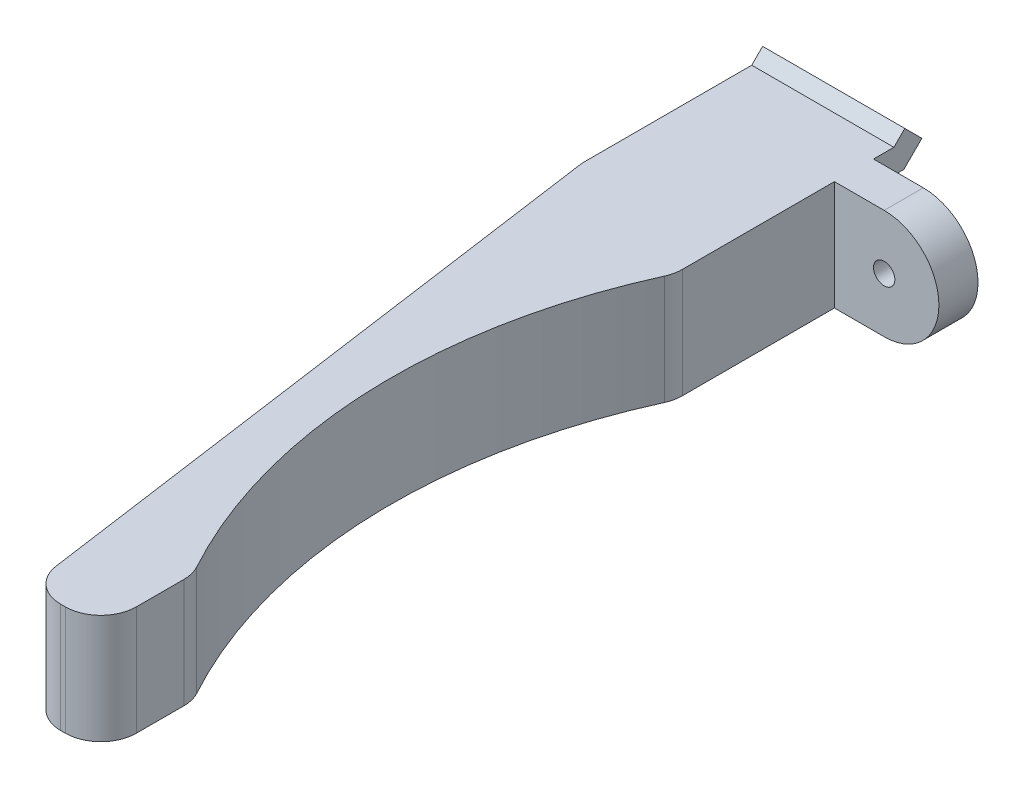
ISO-10303-21;
HEADER;
FILE_DESCRIPTION(('STEP AP214'),'2;1');
FILE_NAME('part.step','',(''),(''),'','','');
FILE_SCHEMA(('AUTOMOTIVE_DESIGN { 1 0 10303 214 1 1 1 1 }'));
ENDSEC;
DATA;
#1=APPLICATION_CONTEXT('core data for automotive mechanical design processes');
#2=APPLICATION_PROTOCOL_DEFINITION('international standard','automotive_design',2000,#1);
#3=PRODUCT_CONTEXT('',#1,'mechanical');
#4=PRODUCT('Part','Part','',(#3));
#5=PRODUCT_RELATED_PRODUCT_CATEGORY('part','',(#4));
#6=PRODUCT_DEFINITION_FORMATION('','',#4);
#7=PRODUCT_DEFINITION_CONTEXT('part definition',#1,'design');
#8=PRODUCT_DEFINITION('design','',#6,#7);
#9=PRODUCT_DEFINITION_SHAPE('','',#8);
#10=(LENGTH_UNIT() NAMED_UNIT(*) SI_UNIT(.MILLI.,.METRE.));
#11=(NAMED_UNIT(*) PLANE_ANGLE_UNIT() SI_UNIT($,.RADIAN.));
#12=(NAMED_UNIT(*) SI_UNIT($,.STERADIAN.) SOLID_ANGLE_UNIT());
#13=UNCERTAINTY_MEASURE_WITH_UNIT(LENGTH_MEASURE(1.E-05),#10,'distance_accuracy_value','');
#14=(GEOMETRIC_REPRESENTATION_CONTEXT(3) GLOBAL_UNCERTAINTY_ASSIGNED_CONTEXT((#13)) GLOBAL_UNIT_ASSIGNED_CONTEXT((#10,
#11,#12)) REPRESENTATION_CONTEXT('',''));
#15=CARTESIAN_POINT('',(0.,0.,0.));
#16=DIRECTION('',(0.,0.,1.));
#17=DIRECTION('',(1.,0.,0.));
#18=AXIS2_PLACEMENT_3D('',#15,#16,#17);
#19=CARTESIAN_POINT('',(5.,-5.8181568544759,5.));
#20=DIRECTION('',(-1.,0.,0.));
#21=DIRECTION('',(0.,0.,1.));
#22=AXIS2_PLACEMENT_3D('',#19,#20,#21);
#23=PLANE('',#22);
#24=DIRECTION('',(0.,0.,1.));
#25=VECTOR('',#24,1.);
#26=CARTESIAN_POINT('',(5.,5.770255584937,-0.149999999997353));
#27=LINE('',#26,#25);
#28=CARTESIAN_POINT('',(5.,5.770255584937,-1.43370490960713));
#29=VERTEX_POINT('',#28);
#30=CARTESIAN_POINT('',(5.,5.770255584937,0.));
#31=VERTEX_POINT('',#30);
#32=EDGE_CURVE('E324',#29,#31,#27,.T.);
#33=ORIENTED_EDGE('',*,*,#32,.T.);
#34=DIRECTION('',(0.,-1.,0.));
#35=VECTOR('',#34,1.);
#36=CARTESIAN_POINT('',(5.,-1.92974441506292,0.));
#37=LINE('',#36,#35);
#38=CARTESIAN_POINT('',(5.,4.07025558493702,0.));
#39=VERTEX_POINT('',#38);
#40=EDGE_CURVE('E212',#31,#39,#37,.T.);
#41=ORIENTED_EDGE('',*,*,#40,.T.);
#42=DIRECTION('',(0.,-1.27213054907211E-13,-1.));
#43=VECTOR('',#42,1.);
#44=CARTESIAN_POINT('',(5.,4.07025558493702,0.));
#45=LINE('',#44,#43);
#46=CARTESIAN_POINT('',(5.,4.070255584937,-2.13786796564139));
#47=VERTEX_POINT('',#46);
#48=EDGE_CURVE('E297',#39,#47,#45,.T.);
#49=ORIENTED_EDGE('',*,*,#48,.T.);
#50=DIRECTION('',(0.,0.707106781186548,-0.707106781186547));
#51=VECTOR('',#50,1.);
#52=CARTESIAN_POINT('',(5.,5.3344691473101,-3.40208152801448));
#53=LINE('',#52,#51);
#54=CARTESIAN_POINT('',(5.,5.3344691473101,-3.40208152801448));
#55=VERTEX_POINT('',#54);
#56=EDGE_CURVE('E295',#47,#55,#53,.T.);
#57=ORIENTED_EDGE('',*,*,#56,.T.);
#58=DIRECTION('',(0.,0.707106781186546,0.707106781186549));
#59=VECTOR('',#58,1.);
#60=CARTESIAN_POINT('',(5.,6.53655067532722,-2.19999999999735));
#61=LINE('',#60,#59);
#62=CARTESIAN_POINT('',(5.,6.53655067532722,-2.19999999999735));
#63=VERTEX_POINT('',#62);
#64=EDGE_CURVE('E292',#55,#63,#61,.T.);
#65=ORIENTED_EDGE('',*,*,#64,.T.);
#66=DIRECTION('',(0.,-0.707106781186548,0.707106781186547));
#67=VECTOR('',#66,1.);
#68=CARTESIAN_POINT('',(5.,5.770255584937,-1.43370490960713));
#69=LINE('',#68,#67);
#70=EDGE_CURVE('E290',#63,#29,#69,.T.);
#71=ORIENTED_EDGE('',*,*,#70,.T.);
#72=EDGE_LOOP('',(#33,#41,#49,#57,#65,#71));
#73=FACE_BOUND('',#72,.T.);
#74=ADVANCED_FACE('F33',(#73),#23,.F.);
#75=DIRECTION('',(0.,0.,1.));
#76=VECTOR('',#75,1.);
#77=CARTESIAN_POINT('',(5.,-0.229744415063001,-0.149999999997353));
#78=LINE('',#77,#76);
#79=CARTESIAN_POINT('',(5.,-0.229744415063001,-1.43370490960713));
#80=VERTEX_POINT('',#79);
#81=CARTESIAN_POINT('',(5.,-0.229744415063001,0.));
#82=VERTEX_POINT('',#81);
#83=EDGE_CURVE('E209',#80,#82,#78,.T.);
#84=ORIENTED_EDGE('',*,*,#83,.T.);
#85=CARTESIAN_POINT('',(5.,-1.92974441506292,0.));
#86=VERTEX_POINT('',#85);
#87=EDGE_CURVE('E206',#82,#86,#37,.T.);
#88=ORIENTED_EDGE('',*,*,#87,.T.);
#89=DIRECTION('',(0.,0.,-1.));
#90=VECTOR('',#89,1.);
#91=CARTESIAN_POINT('',(5.,-1.929744415063,-0.149999999997353));
#92=LINE('',#91,#90);
#93=CARTESIAN_POINT('',(5.,-1.929744415063,-2.13786796564139));
#94=VERTEX_POINT('',#93);
#95=EDGE_CURVE('E189',#86,#94,#92,.T.);
#96=ORIENTED_EDGE('',*,*,#95,.T.);
#97=DIRECTION('',(0.,0.707106781186549,-0.707106781186546));
#98=VECTOR('',#97,1.);
#99=CARTESIAN_POINT('',(5.,-0.665530852689905,-3.40208152801448));
#100=LINE('',#99,#98);
#101=CARTESIAN_POINT('',(5.,-0.665530852689905,-3.40208152801448));
#102=VERTEX_POINT('',#101);
#103=EDGE_CURVE('E202',#94,#102,#100,.T.);
#104=ORIENTED_EDGE('',*,*,#103,.T.);
#105=DIRECTION('',(0.,0.707106781186548,0.707106781186548));
#106=VECTOR('',#105,1.);
#107=CARTESIAN_POINT('',(5.,0.536550675327224,-2.19999999999735));
#108=LINE('',#107,#106);
#109=CARTESIAN_POINT('',(5.,0.536550675327225,-2.19999999999735));
#110=VERTEX_POINT('',#109);
#111=EDGE_CURVE('E263',#102,#110,#108,.T.);
#112=ORIENTED_EDGE('',*,*,#111,.T.);
#113=DIRECTION('',(0.,-0.707106781186546,0.707106781186549));
#114=VECTOR('',#113,1.);
#115=CARTESIAN_POINT('',(5.,-0.229744415063001,-1.43370490960713));
#116=LINE('',#115,#114);
#117=EDGE_CURVE('E261',#110,#80,#116,.T.);
#118=ORIENTED_EDGE('',*,*,#117,.T.);
#119=EDGE_LOOP('',(#84,#88,#96,#104,#112,#118));
#120=FACE_BOUND('',#119,.T.);
#121=ADVANCED_FACE('F207',(#120),#23,.F.);
#122=CARTESIAN_POINT('',(5.,5.770255584937,2.75000000000266));
#123=VERTEX_POINT('',#122);
#124=CARTESIAN_POINT('',(5.,5.770255584937,13.4501334916828));
#125=VERTEX_POINT('',#124);
#126=EDGE_CURVE('E299',#123,#125,#27,.T.);
#127=ORIENTED_EDGE('',*,*,#126,.T.);
#128=DIRECTION('',(0.,-1.,0.));
#129=VECTOR('',#128,1.);
#130=CARTESIAN_POINT('',(5.,-1.92974441506298,13.4501334916828));
#131=LINE('',#130,#129);
#132=CARTESIAN_POINT('',(5.,-1.92974441506298,13.4501334916828));
#133=VERTEX_POINT('',#132);
#134=EDGE_CURVE('E353',#125,#133,#131,.T.);
#135=ORIENTED_EDGE('',*,*,#134,.T.);
#136=CARTESIAN_POINT('',(5.,-1.929744415063,2.75000000000266));
#137=VERTEX_POINT('',#136);
#138=EDGE_CURVE('E201',#133,#137,#92,.T.);
#139=ORIENTED_EDGE('',*,*,#138,.T.);
#140=DIRECTION('',(0.,-1.,0.));
#141=VECTOR('',#140,1.);
#142=CARTESIAN_POINT('',(5.,-1.92974441506292,2.75000000000266));
#143=LINE('',#142,#141);
#144=EDGE_CURVE('E417',#123,#137,#143,.T.);
#145=ORIENTED_EDGE('',*,*,#144,.F.);
#146=EDGE_LOOP('',(#127,#135,#139,#145));
#147=FACE_BOUND('',#146,.T.);
#148=ADVANCED_FACE('F442',(#147),#23,.F.);
#149=CARTESIAN_POINT('',(-5.,-5.8181568544759,5.));
#150=DIRECTION('',(1.,0.,0.));
#151=DIRECTION('',(0.,0.,-1.));
#152=AXIS2_PLACEMENT_3D('',#149,#150,#151);
#153=PLANE('',#152);
#154=DIRECTION('',(0.,0.,1.));
#155=VECTOR('',#154,1.);
#156=CARTESIAN_POINT('',(-5.,-1.929744415063,-0.149999999997353));
#157=LINE('',#156,#155);
#158=CARTESIAN_POINT('',(-5.,-1.929744415063,-2.13786796564139));
#159=VERTEX_POINT('',#158);
#160=CARTESIAN_POINT('',(-5.,-1.92974441506299,10.5));
#161=VERTEX_POINT('',#160);
#162=EDGE_CURVE('E277',#159,#161,#157,.T.);
#163=ORIENTED_EDGE('',*,*,#162,.T.);
#164=DIRECTION('',(0.,1.,0.));
#165=VECTOR('',#164,1.);
#166=CARTESIAN_POINT('',(-5.,-53.8851870945324,10.5));
#167=LINE('',#166,#165);
#168=CARTESIAN_POINT('',(-5.,5.770255584937,10.5));
#169=VERTEX_POINT('',#168);
#170=EDGE_CURVE('E256',#161,#169,#167,.T.);
#171=ORIENTED_EDGE('',*,*,#170,.T.);
#172=DIRECTION('',(0.,0.,-1.));
#173=VECTOR('',#172,1.);
#174=CARTESIAN_POINT('',(-5.,5.770255584937,-0.149999999997353));
#175=LINE('',#174,#173);
#176=CARTESIAN_POINT('',(-5.,5.770255584937,-1.43370490960713));
#177=VERTEX_POINT('',#176);
#178=EDGE_CURVE('E289',#169,#177,#175,.T.);
#179=ORIENTED_EDGE('',*,*,#178,.T.);
#180=DIRECTION('',(0.,0.707106781186548,-0.707106781186547));
#181=VECTOR('',#180,1.);
#182=CARTESIAN_POINT('',(-5.,5.770255584937,-1.43370490960713));
#183=LINE('',#182,#181);
#184=CARTESIAN_POINT('',(-5.,6.53655067532722,-2.19999999999735));
#185=VERTEX_POINT('',#184);
#186=EDGE_CURVE('E302',#177,#185,#183,.T.);
#187=ORIENTED_EDGE('',*,*,#186,.T.);
#188=DIRECTION('',(0.,-0.707106781186546,-0.707106781186549));
#189=VECTOR('',#188,1.);
#190=CARTESIAN_POINT('',(-5.,6.53655067532722,-2.19999999999735));
#191=LINE('',#190,#189);
#192=CARTESIAN_POINT('',(-5.,5.3344691473101,-3.40208152801448));
#193=VERTEX_POINT('',#192);
#194=EDGE_CURVE('E305',#185,#193,#191,.T.);
#195=ORIENTED_EDGE('',*,*,#194,.T.);
#196=DIRECTION('',(0.,-0.707106781186548,0.707106781186547));
#197=VECTOR('',#196,1.);
#198=CARTESIAN_POINT('',(-5.,5.3344691473101,-3.40208152801448));
#199=LINE('',#198,#197);
#200=CARTESIAN_POINT('',(-5.,4.070255584937,-2.13786796564139));
#201=VERTEX_POINT('',#200);
#202=EDGE_CURVE('E308',#193,#201,#199,.T.);
#203=ORIENTED_EDGE('',*,*,#202,.T.);
#204=DIRECTION('',(0.,1.27213054907211E-13,1.));
#205=VECTOR('',#204,1.);
#206=CARTESIAN_POINT('',(-5.,4.07025558493702,0.));
#207=LINE('',#206,#205);
#208=CARTESIAN_POINT('',(-5.,4.07025558493702,0.));
#209=VERTEX_POINT('',#208);
#210=EDGE_CURVE('E311',#201,#209,#207,.T.);
#211=ORIENTED_EDGE('',*,*,#210,.T.);
#212=DIRECTION('',(0.,-1.,0.));
#213=VECTOR('',#212,1.);
#214=CARTESIAN_POINT('',(-5.,-5.8181568544759,0.));
#215=LINE('',#214,#213);
#216=CARTESIAN_POINT('',(-5.,-0.229744415063002,0.));
#217=VERTEX_POINT('',#216);
#218=EDGE_CURVE('E326',#209,#217,#215,.T.);
#219=ORIENTED_EDGE('',*,*,#218,.T.);
#220=DIRECTION('',(0.,0.,-1.));
#221=VECTOR('',#220,1.);
#222=CARTESIAN_POINT('',(-5.,-0.229744415063001,-0.149999999997353));
#223=LINE('',#222,#221);
#224=CARTESIAN_POINT('',(-5.,-0.229744415063001,-1.43370490960713));
#225=VERTEX_POINT('',#224);
#226=EDGE_CURVE('E253',#217,#225,#223,.T.);
#227=ORIENTED_EDGE('',*,*,#226,.T.);
#228=DIRECTION('',(0.,0.707106781186546,-0.707106781186549));
#229=VECTOR('',#228,1.);
#230=CARTESIAN_POINT('',(-5.,-0.229744415063001,-1.43370490960713));
#231=LINE('',#230,#229);
#232=CARTESIAN_POINT('',(-5.,0.536550675327224,-2.19999999999735));
#233=VERTEX_POINT('',#232);
#234=EDGE_CURVE('E268',#225,#233,#231,.T.);
#235=ORIENTED_EDGE('',*,*,#234,.T.);
#236=DIRECTION('',(0.,-0.707106781186548,-0.707106781186548));
#237=VECTOR('',#236,1.);
#238=CARTESIAN_POINT('',(-5.,0.536550675327224,-2.19999999999735));
#239=LINE('',#238,#237);
#240=CARTESIAN_POINT('',(-5.,-0.665530852689905,-3.40208152801448));
#241=VERTEX_POINT('',#240);
#242=EDGE_CURVE('E271',#233,#241,#239,.T.);
#243=ORIENTED_EDGE('',*,*,#242,.T.);
#244=DIRECTION('',(0.,-0.707106781186549,0.707106781186546));
#245=VECTOR('',#244,1.);
#246=CARTESIAN_POINT('',(-5.,-0.665530852689905,-3.40208152801448));
#247=LINE('',#246,#245);
#248=EDGE_CURVE('E274',#241,#159,#247,.T.);
#249=ORIENTED_EDGE('',*,*,#248,.T.);
#250=EDGE_LOOP('',(#163,#171,#179,#187,#195,#203,#211,#219,#227,#235,#243,#249));
#251=FACE_BOUND('',#250,.T.);
#252=ADVANCED_FACE('F374',(#251),#153,.F.);
#253=CARTESIAN_POINT('',(0.,0.,0.));
#254=DIRECTION('',(0.,0.,-1.));
#255=DIRECTION('',(-1.,0.,0.));
#256=AXIS2_PLACEMENT_3D('',#253,#254,#255);
#257=PLANE('',#256);
#258=DIRECTION('',(-1.,0.,0.));
#259=VECTOR('',#258,1.);
#260=CARTESIAN_POINT('',(9.20199597764447,-0.229744415063002,0.));
#261=LINE('',#260,#259);
#262=EDGE_CURVE('E279',#82,#217,#261,.T.);
#263=ORIENTED_EDGE('',*,*,#262,.T.);
#264=ORIENTED_EDGE('',*,*,#218,.F.);
#265=DIRECTION('',(-1.,0.,0.));
#266=VECTOR('',#265,1.);
#267=CARTESIAN_POINT('',(9.20199597764447,4.07025558493702,0.));
#268=LINE('',#267,#266);
#269=EDGE_CURVE('E293',#39,#209,#268,.T.);
#270=ORIENTED_EDGE('',*,*,#269,.F.);
#271=ORIENTED_EDGE('',*,*,#40,.F.);
#272=DIRECTION('',(-1.,0.,0.));
#273=VECTOR('',#272,1.);
#274=CARTESIAN_POINT('',(5.,5.77025558493708,0.));
#275=LINE('',#274,#273);
#276=CARTESIAN_POINT('',(8.5,5.77025558493708,0.));
#277=VERTEX_POINT('',#276);
#278=EDGE_CURVE('E221',#277,#31,#275,.T.);
#279=ORIENTED_EDGE('',*,*,#278,.F.);
#280=CARTESIAN_POINT('',(8.5,1.92025558493704,0.));
#281=DIRECTION('',(0.,0.,1.));
#282=DIRECTION('',(-1.,0.,0.));
#283=AXIS2_PLACEMENT_3D('',#280,#281,#282);
#284=CIRCLE('',#283,3.85);
#285=CARTESIAN_POINT('',(8.5,-1.92974441506296,0.));
#286=VERTEX_POINT('',#285);
#287=EDGE_CURVE('E219',#286,#277,#284,.T.);
#288=ORIENTED_EDGE('',*,*,#287,.F.);
#289=DIRECTION('',(1.,0.,0.));
#290=VECTOR('',#289,1.);
#291=CARTESIAN_POINT('',(8.5,-1.92974441506292,0.));
#292=LINE('',#291,#290);
#293=EDGE_CURVE('E195',#86,#286,#292,.T.);
#294=ORIENTED_EDGE('',*,*,#293,.F.);
#295=ORIENTED_EDGE('',*,*,#87,.F.);
#296=EDGE_LOOP('',(#263,#264,#270,#271,#279,#288,#294,#295));
#297=FACE_BOUND('',#296,.T.);
#298=CARTESIAN_POINT('',(8.5,1.92025558493704,0.));
#299=DIRECTION('',(0.,0.,1.));
#300=DIRECTION('',(1.,0.,0.));
#301=AXIS2_PLACEMENT_3D('',#298,#299,#300);
#302=CIRCLE('',#301,0.750000000002417);
#303=CARTESIAN_POINT('',(9.25000000000242,1.92025558493704,0.));
#304=VERTEX_POINT('',#303);
#305=EDGE_CURVE('E213',#304,#304,#302,.T.);
#306=ORIENTED_EDGE('',*,*,#305,.T.);
#307=EDGE_LOOP('',(#306));
#308=FACE_BOUND('',#307,.T.);
#309=ADVANCED_FACE('F215',(#297,#308),#257,.T.);
#310=CARTESIAN_POINT('',(9.20199597764447,4.07025558493702,0.));
#311=DIRECTION('',(0.,-1.,1.27213054907211E-13));
#312=DIRECTION('',(0.,-1.27213054907211E-13,-1.));
#313=AXIS2_PLACEMENT_3D('',#310,#311,#312);
#314=PLANE('',#313);
#315=ORIENTED_EDGE('',*,*,#48,.F.);
#316=ORIENTED_EDGE('',*,*,#269,.T.);
#317=ORIENTED_EDGE('',*,*,#210,.F.);
#318=DIRECTION('',(-1.,0.,0.));
#319=VECTOR('',#318,1.);
#320=CARTESIAN_POINT('',(9.20199597764447,4.070255584937,-2.13786796564139));
#321=LINE('',#320,#319);
#322=EDGE_CURVE('E317',#47,#201,#321,.T.);
#323=ORIENTED_EDGE('',*,*,#322,.F.);
#324=EDGE_LOOP('',(#315,#316,#317,#323));
#325=FACE_BOUND('',#324,.T.);
#326=ADVANCED_FACE('F396',(#325),#314,.T.);
#327=CARTESIAN_POINT('',(9.20199597764447,5.3344691473101,-3.40208152801448));
#328=DIRECTION('',(0.,-0.707106781186547,-0.707106781186548));
#329=DIRECTION('',(0.,0.707106781186548,-0.707106781186547));
#330=AXIS2_PLACEMENT_3D('',#327,#328,#329);
#331=PLANE('',#330);
#332=ORIENTED_EDGE('',*,*,#56,.F.);
#333=ORIENTED_EDGE('',*,*,#322,.T.);
#334=ORIENTED_EDGE('',*,*,#202,.F.);
#335=DIRECTION('',(-1.,0.,0.));
#336=VECTOR('',#335,1.);
#337=CARTESIAN_POINT('',(9.20199597764447,5.3344691473101,-3.40208152801448));
#338=LINE('',#337,#336);
#339=EDGE_CURVE('E319',#55,#193,#338,.T.);
#340=ORIENTED_EDGE('',*,*,#339,.F.);
#341=EDGE_LOOP('',(#332,#333,#334,#340));
#342=FACE_BOUND('',#341,.T.);
#343=ADVANCED_FACE('F579',(#342),#331,.T.);
#344=CARTESIAN_POINT('',(9.20199597764447,6.53655067532722,-2.19999999999735));
#345=DIRECTION('',(0.,0.707106781186549,-0.707106781186546));
#346=DIRECTION('',(0.,0.707106781186546,0.707106781186549));
#347=AXIS2_PLACEMENT_3D('',#344,#345,#346);
#348=PLANE('',#347);
#349=ORIENTED_EDGE('',*,*,#64,.F.);
#350=ORIENTED_EDGE('',*,*,#339,.T.);
#351=ORIENTED_EDGE('',*,*,#194,.F.);
#352=DIRECTION('',(-1.,0.,0.));
#353=VECTOR('',#352,1.);
#354=CARTESIAN_POINT('',(9.20199597764447,6.53655067532722,-2.19999999999735));
#355=LINE('',#354,#353);
#356=EDGE_CURVE('E321',#63,#185,#355,.T.);
#357=ORIENTED_EDGE('',*,*,#356,.F.);
#358=EDGE_LOOP('',(#349,#350,#351,#357));
#359=FACE_BOUND('',#358,.T.);
#360=ADVANCED_FACE('F640',(#359),#348,.T.);
#361=CARTESIAN_POINT('',(9.20199597764447,5.770255584937,-1.43370490960713));
#362=DIRECTION('',(0.,0.707106781186547,0.707106781186548));
#363=DIRECTION('',(0.,-0.707106781186548,0.707106781186547));
#364=AXIS2_PLACEMENT_3D('',#361,#362,#363);
#365=PLANE('',#364);
#366=ORIENTED_EDGE('',*,*,#70,.F.);
#367=ORIENTED_EDGE('',*,*,#356,.T.);
#368=ORIENTED_EDGE('',*,*,#186,.F.);
#369=DIRECTION('',(-1.,0.,0.));
#370=VECTOR('',#369,1.);
#371=CARTESIAN_POINT('',(9.20199597764447,5.770255584937,-1.43370490960713));
#372=LINE('',#371,#370);
#373=EDGE_CURVE('E314',#29,#177,#372,.T.);
#374=ORIENTED_EDGE('',*,*,#373,.F.);
#375=EDGE_LOOP('',(#366,#367,#368,#374));
#376=FACE_BOUND('',#375,.T.);
#377=ADVANCED_FACE('F534',(#376),#365,.T.);
#378=CARTESIAN_POINT('',(9.20199597764447,5.770255584937,-0.149999999997353));
#379=DIRECTION('',(0.,1.,0.));
#380=DIRECTION('',(0.,0.,1.));
#381=AXIS2_PLACEMENT_3D('',#378,#379,#380);
#382=PLANE('',#381);
#383=DIRECTION('',(0.,0.,-1.));
#384=VECTOR('',#383,1.);
#385=CARTESIAN_POINT('',(6.35244572854812,5.770255584937,55.7));
#386=LINE('',#385,#384);
#387=CARTESIAN_POINT('',(6.35244572854812,5.770255584937,53.2));
#388=VERTEX_POINT('',#387);
#389=CARTESIAN_POINT('',(6.35244572854812,5.770255584937,49.8497116646296));
#390=VERTEX_POINT('',#389);
#391=EDGE_CURVE('E243',#388,#390,#386,.T.);
#392=ORIENTED_EDGE('',*,*,#391,.T.);
#393=CARTESIAN_POINT('',(3.85244572854812,5.770255584937,49.8497116646296));
#394=DIRECTION('',(0.,1.,0.));
#395=DIRECTION('',(0.,0.,1.));
#396=AXIS2_PLACEMENT_3D('',#393,#394,#395);
#397=CIRCLE('',#396,2.5);
#398=CARTESIAN_POINT('',(6.04589541498279,5.770255584937,48.6502207421631));
#399=VERTEX_POINT('',#398);
#400=EDGE_CURVE('E340',#390,#399,#397,.T.);
#401=ORIENTED_EDGE('',*,*,#400,.T.);
#402=CARTESIAN_POINT('',(39.6088986863946,5.770255584937,30.2962470888115));
#403=DIRECTION('',(0.,-1.,0.));
#404=DIRECTION('',(0.,0.,1.));
#405=AXIS2_PLACEMENT_3D('',#402,#403,#404);
#406=CIRCLE('',#405,38.2536735159477);
#407=CARTESIAN_POINT('',(4.77641433795368,5.770255584937,14.4835442338173));
#408=VERTEX_POINT('',#407);
#409=EDGE_CURVE('E240',#399,#408,#406,.T.);
#410=ORIENTED_EDGE('',*,*,#409,.T.);
#411=CARTESIAN_POINT('',(2.5,5.770255584937,13.4501334916828));
#412=DIRECTION('',(0.,1.,0.));
#413=DIRECTION('',(0.,0.,1.));
#414=AXIS2_PLACEMENT_3D('',#411,#412,#413);
#415=CIRCLE('',#414,2.5);
#416=EDGE_CURVE('E338',#408,#125,#415,.T.);
#417=ORIENTED_EDGE('',*,*,#416,.T.);
#418=ORIENTED_EDGE('',*,*,#126,.F.);
#419=DIRECTION('',(-1.,0.,0.));
#420=VECTOR('',#419,1.);
#421=CARTESIAN_POINT('',(5.,5.77025558493708,2.75000000000266));
#422=LINE('',#421,#420);
#423=CARTESIAN_POINT('',(8.5,5.77025558493708,2.75000000000266));
#424=VERTEX_POINT('',#423);
#425=EDGE_CURVE('E235',#424,#123,#422,.T.);
#426=ORIENTED_EDGE('',*,*,#425,.F.);
#427=DIRECTION('',(0.,0.,-1.));
#428=VECTOR('',#427,1.);
#429=CARTESIAN_POINT('',(8.5,5.77025558493708,13.3948344280246));
#430=LINE('',#429,#428);
#431=EDGE_CURVE('E227',#424,#277,#430,.T.);
#432=ORIENTED_EDGE('',*,*,#431,.T.);
#433=ORIENTED_EDGE('',*,*,#278,.T.);
#434=ORIENTED_EDGE('',*,*,#32,.F.);
#435=ORIENTED_EDGE('',*,*,#373,.T.);
#436=ORIENTED_EDGE('',*,*,#178,.F.);
#437=DIRECTION('',(0.139173100960066,0.,0.99026806874157));
#438=VECTOR('',#437,1.);
#439=CARTESIAN_POINT('',(-5.,5.770255584937,10.5));
#440=LINE('',#439,#438);
#441=CARTESIAN_POINT('',(1.04999240123476,5.770255584937,53.5479327524002));
#442=VERTEX_POINT('',#441);
#443=EDGE_CURVE('E236',#169,#442,#440,.T.);
#444=ORIENTED_EDGE('',*,*,#443,.T.);
#445=CARTESIAN_POINT('',(3.52566257308868,5.770255584937,53.2));
#446=DIRECTION('',(0.,1.,0.));
#447=DIRECTION('',(0.,0.,1.));
#448=AXIS2_PLACEMENT_3D('',#445,#446,#447);
#449=CIRCLE('',#448,2.5);
#450=CARTESIAN_POINT('',(3.52566257308868,5.770255584937,55.7));
#451=VERTEX_POINT('',#450);
#452=EDGE_CURVE('E334',#442,#451,#449,.T.);
#453=ORIENTED_EDGE('',*,*,#452,.T.);
#454=DIRECTION('',(1.,0.,0.));
#455=VECTOR('',#454,1.);
#456=CARTESIAN_POINT('',(1.35244572854812,5.770255584937,55.7));
#457=LINE('',#456,#455);
#458=CARTESIAN_POINT('',(3.85244572854812,5.770255584937,55.7));
#459=VERTEX_POINT('',#458);
#460=EDGE_CURVE('E231',#451,#459,#457,.T.);
#461=ORIENTED_EDGE('',*,*,#460,.T.);
#462=CARTESIAN_POINT('',(3.85244572854812,5.770255584937,53.2));
#463=DIRECTION('',(0.,1.,0.));
#464=DIRECTION('',(0.,0.,1.));
#465=AXIS2_PLACEMENT_3D('',#462,#463,#464);
#466=CIRCLE('',#465,2.5);
#467=EDGE_CURVE('E336',#459,#388,#466,.T.);
#468=ORIENTED_EDGE('',*,*,#467,.T.);
#469=EDGE_LOOP('',(#392,#401,#410,#417,#418,#426,#432,#433,#434,#435,#436,#444,#453,#461,#468));
#470=FACE_BOUND('',#469,.T.);
#471=ADVANCED_FACE('F364',(#470),#382,.T.);
#472=CARTESIAN_POINT('',(9.20199597764447,-1.929744415063,-0.149999999997353));
#473=DIRECTION('',(0.,-1.,0.));
#474=DIRECTION('',(0.,0.,-1.));
#475=AXIS2_PLACEMENT_3D('',#472,#473,#474);
#476=PLANE('',#475);
#477=CARTESIAN_POINT('',(39.6088986863946,-1.92974441506296,30.2962470888115));
#478=DIRECTION('',(0.,-1.,0.));
#479=DIRECTION('',(0.,0.,-1.));
#480=AXIS2_PLACEMENT_3D('',#477,#478,#479);
#481=CIRCLE('',#480,38.2536735159477);
#482=CARTESIAN_POINT('',(6.04589541498279,-1.92974441506293,48.6502207421631));
#483=VERTEX_POINT('',#482);
#484=CARTESIAN_POINT('',(4.77641433795368,-1.92974441506298,14.4835442338173));
#485=VERTEX_POINT('',#484);
#486=EDGE_CURVE('E250',#483,#485,#481,.T.);
#487=ORIENTED_EDGE('',*,*,#486,.F.);
#488=CARTESIAN_POINT('',(3.85244572854812,-1.92974441506293,49.8497116646296));
#489=DIRECTION('',(0.,-1.,0.));
#490=DIRECTION('',(0.,0.,-1.));
#491=AXIS2_PLACEMENT_3D('',#488,#489,#490);
#492=CIRCLE('',#491,2.5);
#493=CARTESIAN_POINT('',(6.35244572854812,-1.92974441506293,49.8497116646296));
#494=VERTEX_POINT('',#493);
#495=EDGE_CURVE('E351',#483,#494,#492,.T.);
#496=ORIENTED_EDGE('',*,*,#495,.T.);
#497=DIRECTION('',(0.,0.,-1.));
#498=VECTOR('',#497,1.);
#499=CARTESIAN_POINT('',(6.35244572854812,-1.92974441506292,55.6999999999999));
#500=LINE('',#499,#498);
#501=CARTESIAN_POINT('',(6.35244572854812,-1.92974441506292,53.2));
#502=VERTEX_POINT('',#501);
#503=EDGE_CURVE('E239',#502,#494,#500,.T.);
#504=ORIENTED_EDGE('',*,*,#503,.F.);
#505=CARTESIAN_POINT('',(3.85244572854812,-1.92974441506293,53.2));
#506=DIRECTION('',(0.,-1.,0.));
#507=DIRECTION('',(0.,0.,-1.));
#508=AXIS2_PLACEMENT_3D('',#505,#506,#507);
#509=CIRCLE('',#508,2.5);
#510=CARTESIAN_POINT('',(3.85244572854812,-1.92974441506292,55.7));
#511=VERTEX_POINT('',#510);
#512=EDGE_CURVE('E54',#502,#511,#509,.T.);
#513=ORIENTED_EDGE('',*,*,#512,.T.);
#514=DIRECTION('',(1.,0.,0.));
#515=VECTOR('',#514,1.);
#516=CARTESIAN_POINT('',(1.35244572854812,-1.92974441506292,55.7));
#517=LINE('',#516,#515);
#518=CARTESIAN_POINT('',(3.52566257308868,-1.92974441506292,55.7));
#519=VERTEX_POINT('',#518);
#520=EDGE_CURVE('E251',#519,#511,#517,.T.);
#521=ORIENTED_EDGE('',*,*,#520,.F.);
#522=CARTESIAN_POINT('',(3.52566257308868,-1.92974441506293,53.2));
#523=DIRECTION('',(0.,-1.,0.));
#524=DIRECTION('',(0.,0.,-1.));
#525=AXIS2_PLACEMENT_3D('',#522,#523,#524);
#526=CIRCLE('',#525,2.5);
#527=CARTESIAN_POINT('',(1.04999240123476,-1.92974441506293,53.5479327524002));
#528=VERTEX_POINT('',#527);
#529=EDGE_CURVE('E48',#519,#528,#526,.T.);
#530=ORIENTED_EDGE('',*,*,#529,.T.);
#531=DIRECTION('',(0.139173100960066,0.,0.99026806874157));
#532=VECTOR('',#531,1.);
#533=CARTESIAN_POINT('',(-5.00000000000001,-1.92974441506299,10.4999999999999));
#534=LINE('',#533,#532);
#535=EDGE_CURVE('E254',#161,#528,#534,.T.);
#536=ORIENTED_EDGE('',*,*,#535,.F.);
#537=ORIENTED_EDGE('',*,*,#162,.F.);
#538=DIRECTION('',(-1.,0.,0.));
#539=VECTOR('',#538,1.);
#540=CARTESIAN_POINT('',(9.20199597764447,-1.929744415063,-2.13786796564139));
#541=LINE('',#540,#539);
#542=EDGE_CURVE('E198',#94,#159,#541,.T.);
#543=ORIENTED_EDGE('',*,*,#542,.F.);
#544=ORIENTED_EDGE('',*,*,#95,.F.);
#545=ORIENTED_EDGE('',*,*,#293,.T.);
#546=DIRECTION('',(0.,0.,-1.));
#547=VECTOR('',#546,1.);
#548=CARTESIAN_POINT('',(8.5,-1.92974441506296,13.3948344280246));
#549=LINE('',#548,#547);
#550=CARTESIAN_POINT('',(8.5,-1.92974441506296,2.75000000000266));
#551=VERTEX_POINT('',#550);
#552=EDGE_CURVE('E229',#551,#286,#549,.T.);
#553=ORIENTED_EDGE('',*,*,#552,.F.);
#554=DIRECTION('',(1.,0.,0.));
#555=VECTOR('',#554,1.);
#556=CARTESIAN_POINT('',(8.5,-1.92974441506292,2.75000000000266));
#557=LINE('',#556,#555);
#558=EDGE_CURVE('E413',#137,#551,#557,.T.);
#559=ORIENTED_EDGE('',*,*,#558,.F.);
#560=ORIENTED_EDGE('',*,*,#138,.F.);
#561=CARTESIAN_POINT('',(2.5,-1.92974441506298,13.4501334916828));
#562=DIRECTION('',(0.,-1.,0.));
#563=DIRECTION('',(0.,0.,-1.));
#564=AXIS2_PLACEMENT_3D('',#561,#562,#563);
#565=CIRCLE('',#564,2.5);
#566=EDGE_CURVE('E349',#133,#485,#565,.T.);
#567=ORIENTED_EDGE('',*,*,#566,.T.);
#568=EDGE_LOOP('',(#487,#496,#504,#513,#521,#530,#536,#537,#543,#544,#545,#553,#559,#560,#567));
#569=FACE_BOUND('',#568,.T.);
#570=ADVANCED_FACE('F192',(#569),#476,.T.);
#571=CARTESIAN_POINT('',(9.20199597764447,-0.665530852689905,-3.40208152801448));
#572=DIRECTION('',(0.,-0.707106781186546,-0.707106781186549));
#573=DIRECTION('',(0.,0.707106781186549,-0.707106781186546));
#574=AXIS2_PLACEMENT_3D('',#571,#572,#573);
#575=PLANE('',#574);
#576=ORIENTED_EDGE('',*,*,#103,.F.);
#577=ORIENTED_EDGE('',*,*,#542,.T.);
#578=ORIENTED_EDGE('',*,*,#248,.F.);
#579=DIRECTION('',(-1.,0.,0.));
#580=VECTOR('',#579,1.);
#581=CARTESIAN_POINT('',(9.20199597764447,-0.665530852689905,-3.40208152801448));
#582=LINE('',#581,#580);
#583=EDGE_CURVE('E281',#102,#241,#582,.T.);
#584=ORIENTED_EDGE('',*,*,#583,.F.);
#585=EDGE_LOOP('',(#576,#577,#578,#584));
#586=FACE_BOUND('',#585,.T.);
#587=ADVANCED_FACE('F378',(#586),#575,.T.);
#588=CARTESIAN_POINT('',(9.20199597764447,0.536550675327224,-2.19999999999735));
#589=DIRECTION('',(0.,0.707106781186547,-0.707106781186547));
#590=DIRECTION('',(0.,0.707106781186548,0.707106781186548));
#591=AXIS2_PLACEMENT_3D('',#588,#589,#590);
#592=PLANE('',#591);
#593=ORIENTED_EDGE('',*,*,#111,.F.);
#594=ORIENTED_EDGE('',*,*,#583,.T.);
#595=ORIENTED_EDGE('',*,*,#242,.F.);
#596=DIRECTION('',(-1.,0.,0.));
#597=VECTOR('',#596,1.);
#598=CARTESIAN_POINT('',(9.20199597764447,0.536550675327224,-2.19999999999735));
#599=LINE('',#598,#597);
#600=EDGE_CURVE('E283',#110,#233,#599,.T.);
#601=ORIENTED_EDGE('',*,*,#600,.F.);
#602=EDGE_LOOP('',(#593,#594,#595,#601));
#603=FACE_BOUND('',#602,.T.);
#604=ADVANCED_FACE('F383',(#603),#592,.T.);
#605=CARTESIAN_POINT('',(9.20199597764447,-0.229744415063001,-1.43370490960713));
#606=DIRECTION('',(0.,0.707106781186549,0.707106781186546));
#607=DIRECTION('',(0.,-0.707106781186546,0.707106781186549));
#608=AXIS2_PLACEMENT_3D('',#605,#606,#607);
#609=PLANE('',#608);
#610=ORIENTED_EDGE('',*,*,#117,.F.);
#611=ORIENTED_EDGE('',*,*,#600,.T.);
#612=ORIENTED_EDGE('',*,*,#234,.F.);
#613=DIRECTION('',(-1.,0.,0.));
#614=VECTOR('',#613,1.);
#615=CARTESIAN_POINT('',(9.20199597764447,-0.229744415063001,-1.43370490960713));
#616=LINE('',#615,#614);
#617=EDGE_CURVE('E285',#80,#225,#616,.T.);
#618=ORIENTED_EDGE('',*,*,#617,.F.);
#619=EDGE_LOOP('',(#610,#611,#612,#618));
#620=FACE_BOUND('',#619,.T.);
#621=ADVANCED_FACE('F386',(#620),#609,.T.);
#622=CARTESIAN_POINT('',(9.20199597764447,-0.229744415063001,-0.149999999997353));
#623=DIRECTION('',(0.,1.,0.));
#624=DIRECTION('',(0.,0.,1.));
#625=AXIS2_PLACEMENT_3D('',#622,#623,#624);
#626=PLANE('',#625);
#627=ORIENTED_EDGE('',*,*,#83,.F.);
#628=ORIENTED_EDGE('',*,*,#617,.T.);
#629=ORIENTED_EDGE('',*,*,#226,.F.);
#630=ORIENTED_EDGE('',*,*,#262,.F.);
#631=EDGE_LOOP('',(#627,#628,#629,#630));
#632=FACE_BOUND('',#631,.T.);
#633=ADVANCED_FACE('F389',(#632),#626,.T.);
#634=CARTESIAN_POINT('',(6.35244572854812,-53.8851870945324,55.7));
#635=DIRECTION('',(1.,0.,0.));
#636=DIRECTION('',(0.,0.,-1.));
#637=AXIS2_PLACEMENT_3D('',#634,#635,#636);
#638=PLANE('',#637);
#639=ORIENTED_EDGE('',*,*,#503,.T.);
#640=DIRECTION('',(0.,1.,0.));
#641=VECTOR('',#640,1.);
#642=CARTESIAN_POINT('',(6.35244572854812,-53.8851870945324,49.8497116646296));
#643=LINE('',#642,#641);
#644=EDGE_CURVE('E331',#494,#390,#643,.T.);
#645=ORIENTED_EDGE('',*,*,#644,.T.);
#646=ORIENTED_EDGE('',*,*,#391,.F.);
#647=DIRECTION('',(0.,1.,0.));
#648=VECTOR('',#647,1.);
#649=CARTESIAN_POINT('',(6.35244572854812,-53.8851870945324,53.2));
#650=LINE('',#649,#648);
#651=EDGE_CURVE('E329',#388,#502,#650,.F.);
#652=ORIENTED_EDGE('',*,*,#651,.T.);
#653=EDGE_LOOP('',(#639,#645,#646,#652));
#654=FACE_BOUND('',#653,.T.);
#655=ADVANCED_FACE('F464',(#654),#638,.T.);
#656=CARTESIAN_POINT('',(39.6088986863946,-53.8851870945324,30.2962470888115));
#657=DIRECTION('',(0.,1.,0.));
#658=DIRECTION('',(0.,0.,1.));
#659=AXIS2_PLACEMENT_3D('',#656,#657,#658);
#660=CYLINDRICAL_SURFACE('',#659,38.2536735159477);
#661=ORIENTED_EDGE('',*,*,#409,.F.);
#662=DIRECTION('',(0.,1.,0.));
#663=VECTOR('',#662,1.);
#664=CARTESIAN_POINT('',(6.04589541498279,-53.8851870945324,48.6502207421631));
#665=LINE('',#664,#663);
#666=EDGE_CURVE('E345',#399,#483,#665,.F.);
#667=ORIENTED_EDGE('',*,*,#666,.T.);
#668=ORIENTED_EDGE('',*,*,#486,.T.);
#669=DIRECTION('',(0.,1.,0.));
#670=VECTOR('',#669,1.);
#671=CARTESIAN_POINT('',(4.77641433795368,-53.8851870945324,14.4835442338173));
#672=LINE('',#671,#670);
#673=EDGE_CURVE('E342',#485,#408,#672,.T.);
#674=ORIENTED_EDGE('',*,*,#673,.T.);
#675=EDGE_LOOP('',(#661,#667,#668,#674));
#676=FACE_BOUND('',#675,.T.);
#677=ADVANCED_FACE('F460',(#676),#660,.F.);
#678=CARTESIAN_POINT('',(-5.,-53.8851870945324,10.5));
#679=DIRECTION('',(-0.99026806874157,0.,0.139173100960066));
#680=DIRECTION('',(0.139173100960066,0.,0.99026806874157));
#681=AXIS2_PLACEMENT_3D('',#678,#679,#680);
#682=PLANE('',#681);
#683=ORIENTED_EDGE('',*,*,#535,.T.);
#684=DIRECTION('',(0.,1.,0.));
#685=VECTOR('',#684,1.);
#686=CARTESIAN_POINT('',(1.04999240123476,-53.8851870945324,53.5479327524002));
#687=LINE('',#686,#685);
#688=EDGE_CURVE('E11',#528,#442,#687,.T.);
#689=ORIENTED_EDGE('',*,*,#688,.T.);
#690=ORIENTED_EDGE('',*,*,#443,.F.);
#691=ORIENTED_EDGE('',*,*,#170,.F.);
#692=EDGE_LOOP('',(#683,#689,#690,#691));
#693=FACE_BOUND('',#692,.T.);
#694=ADVANCED_FACE('F370',(#693),#682,.T.);
#695=CARTESIAN_POINT('',(1.35244572854812,-53.8851870945324,55.7));
#696=DIRECTION('',(0.,0.,1.));
#697=DIRECTION('',(1.,0.,0.));
#698=AXIS2_PLACEMENT_3D('',#695,#696,#697);
#699=PLANE('',#698);
#700=ORIENTED_EDGE('',*,*,#520,.T.);
#701=DIRECTION('',(0.,1.,0.));
#702=VECTOR('',#701,1.);
#703=CARTESIAN_POINT('',(3.85244572854812,-53.8851870945324,55.7));
#704=LINE('',#703,#702);
#705=EDGE_CURVE('E41',#511,#459,#704,.T.);
#706=ORIENTED_EDGE('',*,*,#705,.T.);
#707=ORIENTED_EDGE('',*,*,#460,.F.);
#708=DIRECTION('',(0.,1.,0.));
#709=VECTOR('',#708,1.);
#710=CARTESIAN_POINT('',(3.52566257308868,-53.8851870945324,55.7));
#711=LINE('',#710,#709);
#712=EDGE_CURVE('E355',#451,#519,#711,.F.);
#713=ORIENTED_EDGE('',*,*,#712,.T.);
#714=EDGE_LOOP('',(#700,#706,#707,#713));
#715=FACE_BOUND('',#714,.T.);
#716=ADVANCED_FACE('F360',(#715),#699,.T.);
#717=CARTESIAN_POINT('',(8.5,1.92025558493704,13.3948344280246));
#718=DIRECTION('',(0.,0.,-1.));
#719=DIRECTION('',(-1.,0.,0.));
#720=AXIS2_PLACEMENT_3D('',#717,#718,#719);
#721=CYLINDRICAL_SURFACE('',#720,3.85);
#722=CARTESIAN_POINT('',(8.5,1.92025558493704,2.75000000000266));
#723=DIRECTION('',(0.,0.,1.));
#724=DIRECTION('',(1.,0.,0.));
#725=AXIS2_PLACEMENT_3D('',#722,#723,#724);
#726=CIRCLE('',#725,3.85);
#727=EDGE_CURVE('E409',#551,#424,#726,.T.);
#728=ORIENTED_EDGE('',*,*,#727,.F.);
#729=ORIENTED_EDGE('',*,*,#552,.T.);
#730=ORIENTED_EDGE('',*,*,#287,.T.);
#731=ORIENTED_EDGE('',*,*,#431,.F.);
#732=EDGE_LOOP('',(#728,#729,#730,#731));
#733=FACE_BOUND('',#732,.T.);
#734=ADVANCED_FACE('F408',(#733),#721,.T.);
#735=CARTESIAN_POINT('',(8.5,1.92025558493704,13.3948344280246));
#736=DIRECTION('',(0.,0.,-1.));
#737=DIRECTION('',(-1.,0.,0.));
#738=AXIS2_PLACEMENT_3D('',#735,#736,#737);
#739=CYLINDRICAL_SURFACE('',#738,0.750000000002417);
#740=ORIENTED_EDGE('',*,*,#305,.F.);
#741=EDGE_LOOP('',(#740));
#742=FACE_BOUND('',#741,.T.);
#743=CARTESIAN_POINT('',(8.5,1.92025558493704,2.75000000000266));
#744=DIRECTION('',(0.,0.,1.));
#745=DIRECTION('',(1.,0.,0.));
#746=AXIS2_PLACEMENT_3D('',#743,#744,#745);
#747=CIRCLE('',#746,0.750000000002417);
#748=CARTESIAN_POINT('',(9.25000000000242,1.92025558493704,2.75000000000266));
#749=VERTEX_POINT('',#748);
#750=EDGE_CURVE('E232',#749,#749,#747,.T.);
#751=ORIENTED_EDGE('',*,*,#750,.T.);
#752=EDGE_LOOP('',(#751));
#753=FACE_BOUND('',#752,.T.);
#754=ADVANCED_FACE('F425',(#742,#753),#739,.F.);
#755=CARTESIAN_POINT('',(0.,0.,2.75000000000266));
#756=DIRECTION('',(0.,0.,1.));
#757=DIRECTION('',(1.,0.,0.));
#758=AXIS2_PLACEMENT_3D('',#755,#756,#757);
#759=PLANE('',#758);
#760=ORIENTED_EDGE('',*,*,#750,.F.);
#761=EDGE_LOOP('',(#760));
#762=FACE_BOUND('',#761,.T.);
#763=ORIENTED_EDGE('',*,*,#425,.T.);
#764=ORIENTED_EDGE('',*,*,#144,.T.);
#765=ORIENTED_EDGE('',*,*,#558,.T.);
#766=ORIENTED_EDGE('',*,*,#727,.T.);
#767=EDGE_LOOP('',(#763,#764,#765,#766));
#768=FACE_BOUND('',#767,.T.);
#769=ADVANCED_FACE('F416',(#762,#768),#759,.T.);
#770=CARTESIAN_POINT('',(3.85244572854812,-53.8851870945324,49.8497116646296));
#771=DIRECTION('',(0.,1.,0.));
#772=DIRECTION('',(0.,0.,1.));
#773=AXIS2_PLACEMENT_3D('',#770,#771,#772);
#774=CYLINDRICAL_SURFACE('',#773,2.5);
#775=ORIENTED_EDGE('',*,*,#495,.F.);
#776=ORIENTED_EDGE('',*,*,#666,.F.);
#777=ORIENTED_EDGE('',*,*,#400,.F.);
#778=ORIENTED_EDGE('',*,*,#644,.F.);
#779=EDGE_LOOP('',(#775,#776,#777,#778));
#780=FACE_BOUND('',#779,.T.);
#781=ADVANCED_FACE('F432',(#780),#774,.T.);
#782=CARTESIAN_POINT('',(2.5,-53.8851870945324,13.4501334916828));
#783=DIRECTION('',(0.,1.,0.));
#784=DIRECTION('',(0.,0.,1.));
#785=AXIS2_PLACEMENT_3D('',#782,#783,#784);
#786=CYLINDRICAL_SURFACE('',#785,2.5);
#787=ORIENTED_EDGE('',*,*,#566,.F.);
#788=ORIENTED_EDGE('',*,*,#134,.F.);
#789=ORIENTED_EDGE('',*,*,#416,.F.);
#790=ORIENTED_EDGE('',*,*,#673,.F.);
#791=EDGE_LOOP('',(#787,#788,#789,#790));
#792=FACE_BOUND('',#791,.T.);
#793=ADVANCED_FACE('F437',(#792),#786,.T.);
#794=CARTESIAN_POINT('',(3.85244572854812,-53.8851870945324,53.2));
#795=DIRECTION('',(0.,1.,0.));
#796=DIRECTION('',(0.,0.,1.));
#797=AXIS2_PLACEMENT_3D('',#794,#795,#796);
#798=CYLINDRICAL_SURFACE('',#797,2.5);
#799=ORIENTED_EDGE('',*,*,#512,.F.);
#800=ORIENTED_EDGE('',*,*,#651,.F.);
#801=ORIENTED_EDGE('',*,*,#467,.F.);
#802=ORIENTED_EDGE('',*,*,#705,.F.);
#803=EDGE_LOOP('',(#799,#800,#801,#802));
#804=FACE_BOUND('',#803,.T.);
#805=ADVANCED_FACE('F466',(#804),#798,.T.);
#806=CARTESIAN_POINT('',(3.52566257308868,-53.8851870945324,53.2));
#807=DIRECTION('',(0.,1.,0.));
#808=DIRECTION('',(0.,0.,1.));
#809=AXIS2_PLACEMENT_3D('',#806,#807,#808);
#810=CYLINDRICAL_SURFACE('',#809,2.5);
#811=ORIENTED_EDGE('',*,*,#529,.F.);
#812=ORIENTED_EDGE('',*,*,#712,.F.);
#813=ORIENTED_EDGE('',*,*,#452,.F.);
#814=ORIENTED_EDGE('',*,*,#688,.F.);
#815=EDGE_LOOP('',(#811,#812,#813,#814));
#816=FACE_BOUND('',#815,.T.);
#817=ADVANCED_FACE('F35',(#816),#810,.T.);
#818=CLOSED_SHELL('',(#74,#121,#148,#252,#309,#326,#343,#360,#377,#471,#570,#587,#604,#621,#633,
#655,#677,#694,#716,#734,#754,#769,#781,#793,#805,#817));
#819=MANIFOLD_SOLID_BREP('B2',#818);
#820=ADVANCED_BREP_SHAPE_REPRESENTATION('',(#18,#819),#14);
#821=SHAPE_DEFINITION_REPRESENTATION(#9,#820);
ENDSEC;
END-ISO-10303-21;
